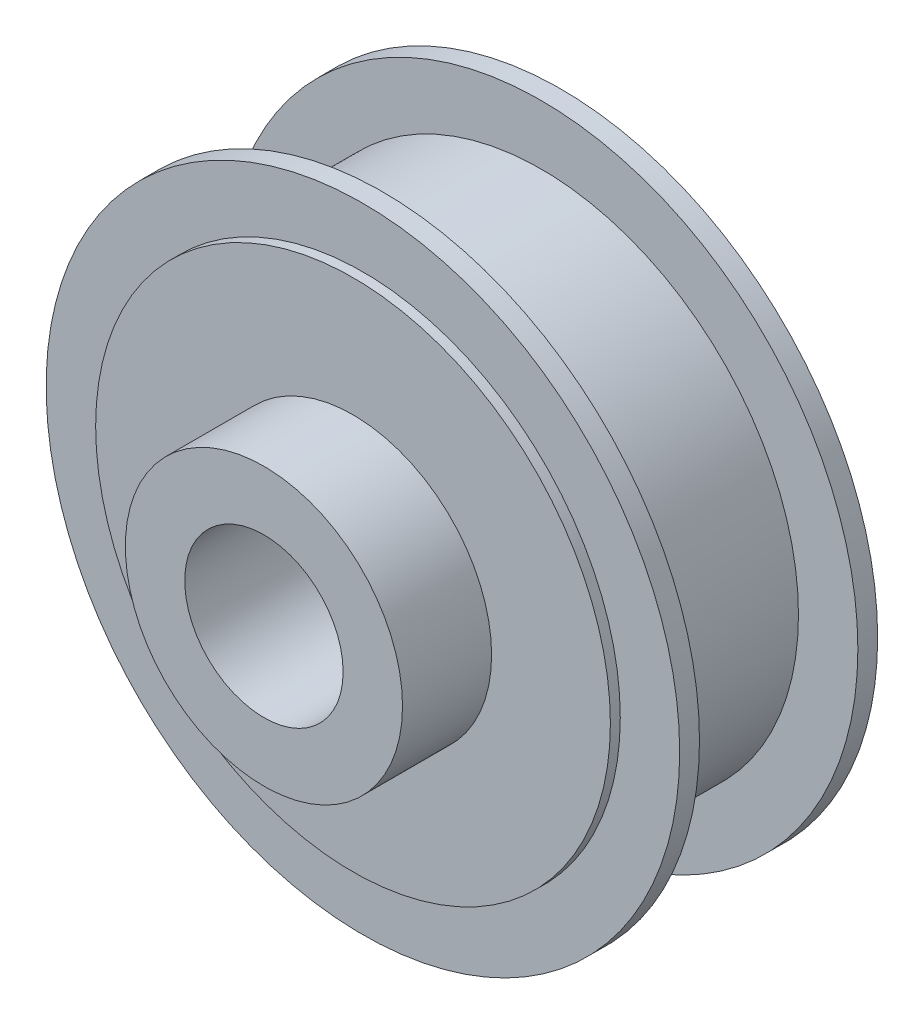
ISO-10303-21;
HEADER;
FILE_DESCRIPTION(('STEP AP214'),'2;1');
FILE_NAME('part.step','',(''),(''),'','','');
FILE_SCHEMA(('AUTOMOTIVE_DESIGN { 1 0 10303 214 1 1 1 1 }'));
ENDSEC;
DATA;
#1=APPLICATION_CONTEXT('core data for automotive mechanical design processes');
#2=APPLICATION_PROTOCOL_DEFINITION('international standard','automotive_design',2000,#1);
#3=PRODUCT_CONTEXT('',#1,'mechanical');
#4=PRODUCT('Part','Part','',(#3));
#5=PRODUCT_RELATED_PRODUCT_CATEGORY('part','',(#4));
#6=PRODUCT_DEFINITION_FORMATION('','',#4);
#7=PRODUCT_DEFINITION_CONTEXT('part definition',#1,'design');
#8=PRODUCT_DEFINITION('design','',#6,#7);
#9=PRODUCT_DEFINITION_SHAPE('','',#8);
#10=(LENGTH_UNIT() NAMED_UNIT(*) SI_UNIT(.MILLI.,.METRE.));
#11=(NAMED_UNIT(*) PLANE_ANGLE_UNIT() SI_UNIT($,.RADIAN.));
#12=(NAMED_UNIT(*) SI_UNIT($,.STERADIAN.) SOLID_ANGLE_UNIT());
#13=UNCERTAINTY_MEASURE_WITH_UNIT(LENGTH_MEASURE(1.E-05),#10,'distance_accuracy_value','');
#14=(GEOMETRIC_REPRESENTATION_CONTEXT(3) GLOBAL_UNCERTAINTY_ASSIGNED_CONTEXT((#13)) GLOBAL_UNIT_ASSIGNED_CONTEXT((#10,
#11,#12)) REPRESENTATION_CONTEXT('',''));
#15=CARTESIAN_POINT('',(0.,0.,0.));
#16=DIRECTION('',(0.,0.,1.));
#17=DIRECTION('',(1.,0.,0.));
#18=AXIS2_PLACEMENT_3D('',#15,#16,#17);
#19=CARTESIAN_POINT('',(0.,0.,1.));
#20=DIRECTION('',(0.,0.,-1.));
#21=DIRECTION('',(-1.,0.,0.));
#22=AXIS2_PLACEMENT_3D('',#19,#20,#21);
#23=CYLINDRICAL_SURFACE('',#22,16.);
#24=CARTESIAN_POINT('',(0.,0.,1.));
#25=DIRECTION('',(0.,0.,1.));
#26=DIRECTION('',(1.,0.,0.));
#27=AXIS2_PLACEMENT_3D('',#24,#25,#26);
#28=CIRCLE('',#27,16.);
#29=CARTESIAN_POINT('',(16.,0.,1.));
#30=VERTEX_POINT('',#29);
#31=EDGE_CURVE('E46',#30,#30,#28,.T.);
#32=ORIENTED_EDGE('',*,*,#31,.F.);
#33=EDGE_LOOP('',(#32));
#34=FACE_BOUND('',#33,.T.);
#35=CARTESIAN_POINT('',(0.,0.,0.));
#36=DIRECTION('',(0.,0.,1.));
#37=DIRECTION('',(1.,0.,0.));
#38=AXIS2_PLACEMENT_3D('',#35,#36,#37);
#39=CIRCLE('',#38,16.);
#40=CARTESIAN_POINT('',(16.,0.,0.));
#41=VERTEX_POINT('',#40);
#42=EDGE_CURVE('E70',#41,#41,#39,.T.);
#43=ORIENTED_EDGE('',*,*,#42,.T.);
#44=EDGE_LOOP('',(#43));
#45=FACE_BOUND('',#44,.T.);
#46=ADVANCED_FACE('F34',(#34,#45),#23,.T.);
#47=CARTESIAN_POINT('',(0.,0.,1.));
#48=DIRECTION('',(0.,0.,1.));
#49=DIRECTION('',(1.,0.,0.));
#50=AXIS2_PLACEMENT_3D('',#47,#48,#49);
#51=PLANE('',#50);
#52=CARTESIAN_POINT('',(0.,0.,1.));
#53=DIRECTION('',(0.,0.,1.));
#54=DIRECTION('',(1.,0.,0.));
#55=AXIS2_PLACEMENT_3D('',#52,#53,#54);
#56=CIRCLE('',#55,13.);
#57=CARTESIAN_POINT('',(13.,0.,1.));
#58=VERTEX_POINT('',#57);
#59=EDGE_CURVE('E41',#58,#58,#56,.T.);
#60=ORIENTED_EDGE('',*,*,#59,.F.);
#61=EDGE_LOOP('',(#60));
#62=FACE_BOUND('',#61,.T.);
#63=ORIENTED_EDGE('',*,*,#31,.T.);
#64=EDGE_LOOP('',(#63));
#65=FACE_BOUND('',#64,.T.);
#66=ADVANCED_FACE('F114',(#62,#65),#51,.T.);
#67=CARTESIAN_POINT('',(0.,0.,0.));
#68=DIRECTION('',(0.,0.,1.));
#69=DIRECTION('',(1.,0.,0.));
#70=AXIS2_PLACEMENT_3D('',#67,#68,#69);
#71=PLANE('',#70);
#72=CARTESIAN_POINT('',(0.,0.,0.));
#73=DIRECTION('',(0.,0.,-1.));
#74=DIRECTION('',(-1.,0.,0.));
#75=AXIS2_PLACEMENT_3D('',#72,#73,#74);
#76=CIRCLE('',#75,13.);
#77=CARTESIAN_POINT('',(-13.,0.,0.));
#78=VERTEX_POINT('',#77);
#79=EDGE_CURVE('E10',#78,#78,#76,.T.);
#80=ORIENTED_EDGE('',*,*,#79,.F.);
#81=EDGE_LOOP('',(#80));
#82=FACE_BOUND('',#81,.T.);
#83=ORIENTED_EDGE('',*,*,#42,.F.);
#84=EDGE_LOOP('',(#83));
#85=FACE_BOUND('',#84,.T.);
#86=ADVANCED_FACE('F119',(#82,#85),#71,.F.);
#87=CARTESIAN_POINT('',(0.,0.,9.));
#88=DIRECTION('',(0.,0.,-1.));
#89=DIRECTION('',(-1.,0.,0.));
#90=AXIS2_PLACEMENT_3D('',#87,#88,#89);
#91=CYLINDRICAL_SURFACE('',#90,13.);
#92=CARTESIAN_POINT('',(0.,0.,9.));
#93=DIRECTION('',(0.,0.,1.));
#94=DIRECTION('',(1.,0.,0.));
#95=AXIS2_PLACEMENT_3D('',#92,#93,#94);
#96=CIRCLE('',#95,13.);
#97=CARTESIAN_POINT('',(13.,0.,9.));
#98=VERTEX_POINT('',#97);
#99=EDGE_CURVE('E66',#98,#98,#96,.T.);
#100=ORIENTED_EDGE('',*,*,#99,.F.);
#101=EDGE_LOOP('',(#100));
#102=FACE_BOUND('',#101,.T.);
#103=ORIENTED_EDGE('',*,*,#59,.T.);
#104=EDGE_LOOP('',(#103));
#105=FACE_BOUND('',#104,.T.);
#106=ADVANCED_FACE('F104',(#102,#105),#91,.T.);
#107=CARTESIAN_POINT('',(0.,0.,10.));
#108=DIRECTION('',(0.,0.,-1.));
#109=DIRECTION('',(-1.,0.,0.));
#110=AXIS2_PLACEMENT_3D('',#107,#108,#109);
#111=CYLINDRICAL_SURFACE('',#110,16.);
#112=CARTESIAN_POINT('',(0.,0.,10.));
#113=DIRECTION('',(0.,0.,1.));
#114=DIRECTION('',(1.,0.,0.));
#115=AXIS2_PLACEMENT_3D('',#112,#113,#114);
#116=CIRCLE('',#115,16.);
#117=CARTESIAN_POINT('',(16.,0.,10.));
#118=VERTEX_POINT('',#117);
#119=EDGE_CURVE('E63',#118,#118,#116,.T.);
#120=ORIENTED_EDGE('',*,*,#119,.F.);
#121=EDGE_LOOP('',(#120));
#122=FACE_BOUND('',#121,.T.);
#123=CARTESIAN_POINT('',(0.,0.,9.));
#124=DIRECTION('',(0.,0.,1.));
#125=DIRECTION('',(1.,0.,0.));
#126=AXIS2_PLACEMENT_3D('',#123,#124,#125);
#127=CIRCLE('',#126,16.);
#128=CARTESIAN_POINT('',(16.,0.,9.));
#129=VERTEX_POINT('',#128);
#130=EDGE_CURVE('E62',#129,#129,#127,.T.);
#131=ORIENTED_EDGE('',*,*,#130,.T.);
#132=EDGE_LOOP('',(#131));
#133=FACE_BOUND('',#132,.T.);
#134=ADVANCED_FACE('F98',(#122,#133),#111,.T.);
#135=CARTESIAN_POINT('',(0.,0.,10.));
#136=DIRECTION('',(0.,0.,1.));
#137=DIRECTION('',(1.,0.,0.));
#138=AXIS2_PLACEMENT_3D('',#135,#136,#137);
#139=PLANE('',#138);
#140=CARTESIAN_POINT('',(0.,0.,10.));
#141=DIRECTION('',(0.,0.,1.));
#142=DIRECTION('',(1.,0.,0.));
#143=AXIS2_PLACEMENT_3D('',#140,#141,#142);
#144=CIRCLE('',#143,13.);
#145=CARTESIAN_POINT('',(13.,0.,10.));
#146=VERTEX_POINT('',#145);
#147=EDGE_CURVE('E56',#146,#146,#144,.T.);
#148=ORIENTED_EDGE('',*,*,#147,.F.);
#149=EDGE_LOOP('',(#148));
#150=FACE_BOUND('',#149,.T.);
#151=ORIENTED_EDGE('',*,*,#119,.T.);
#152=EDGE_LOOP('',(#151));
#153=FACE_BOUND('',#152,.T.);
#154=ADVANCED_FACE('F95',(#150,#153),#139,.T.);
#155=CARTESIAN_POINT('',(0.,0.,9.));
#156=DIRECTION('',(0.,0.,1.));
#157=DIRECTION('',(1.,0.,0.));
#158=AXIS2_PLACEMENT_3D('',#155,#156,#157);
#159=PLANE('',#158);
#160=ORIENTED_EDGE('',*,*,#99,.T.);
#161=EDGE_LOOP('',(#160));
#162=FACE_BOUND('',#161,.T.);
#163=ORIENTED_EDGE('',*,*,#130,.F.);
#164=EDGE_LOOP('',(#163));
#165=FACE_BOUND('',#164,.T.);
#166=ADVANCED_FACE('F91',(#162,#165),#159,.F.);
#167=CARTESIAN_POINT('',(0.,0.,10.5));
#168=DIRECTION('',(0.,0.,-1.));
#169=DIRECTION('',(-1.,0.,0.));
#170=AXIS2_PLACEMENT_3D('',#167,#168,#169);
#171=CYLINDRICAL_SURFACE('',#170,13.);
#172=CARTESIAN_POINT('',(0.,0.,10.5));
#173=DIRECTION('',(0.,0.,1.));
#174=DIRECTION('',(1.,0.,0.));
#175=AXIS2_PLACEMENT_3D('',#172,#173,#174);
#176=CIRCLE('',#175,13.);
#177=CARTESIAN_POINT('',(13.,0.,10.5));
#178=VERTEX_POINT('',#177);
#179=EDGE_CURVE('E52',#178,#178,#176,.T.);
#180=ORIENTED_EDGE('',*,*,#179,.F.);
#181=EDGE_LOOP('',(#180));
#182=FACE_BOUND('',#181,.T.);
#183=ORIENTED_EDGE('',*,*,#147,.T.);
#184=EDGE_LOOP('',(#183));
#185=FACE_BOUND('',#184,.T.);
#186=ADVANCED_FACE('F85',(#182,#185),#171,.T.);
#187=CARTESIAN_POINT('',(0.,0.,10.5));
#188=DIRECTION('',(0.,0.,1.));
#189=DIRECTION('',(1.,0.,0.));
#190=AXIS2_PLACEMENT_3D('',#187,#188,#189);
#191=PLANE('',#190);
#192=CARTESIAN_POINT('',(0.,0.,10.5));
#193=DIRECTION('',(0.,0.,1.));
#194=DIRECTION('',(1.,0.,0.));
#195=AXIS2_PLACEMENT_3D('',#192,#193,#194);
#196=CIRCLE('',#195,7.);
#197=CARTESIAN_POINT('',(7.,0.,10.5));
#198=VERTEX_POINT('',#197);
#199=EDGE_CURVE('E55',#198,#198,#196,.T.);
#200=ORIENTED_EDGE('',*,*,#199,.F.);
#201=EDGE_LOOP('',(#200));
#202=FACE_BOUND('',#201,.T.);
#203=ORIENTED_EDGE('',*,*,#179,.T.);
#204=EDGE_LOOP('',(#203));
#205=FACE_BOUND('',#204,.T.);
#206=ADVANCED_FACE('F81',(#202,#205),#191,.T.);
#207=CARTESIAN_POINT('',(0.,0.,15.));
#208=DIRECTION('',(0.,0.,1.));
#209=DIRECTION('',(1.,0.,0.));
#210=AXIS2_PLACEMENT_3D('',#207,#208,#209);
#211=PLANE('',#210);
#212=CARTESIAN_POINT('',(0.,0.,15.));
#213=DIRECTION('',(0.,0.,1.));
#214=DIRECTION('',(1.,0.,0.));
#215=AXIS2_PLACEMENT_3D('',#212,#213,#214);
#216=CIRCLE('',#215,4.);
#217=CARTESIAN_POINT('',(4.,0.,15.));
#218=VERTEX_POINT('',#217);
#219=EDGE_CURVE('E223',#218,#218,#216,.T.);
#220=ORIENTED_EDGE('',*,*,#219,.F.);
#221=EDGE_LOOP('',(#220));
#222=FACE_BOUND('',#221,.T.);
#223=CARTESIAN_POINT('',(0.,0.,15.));
#224=DIRECTION('',(0.,0.,1.));
#225=DIRECTION('',(1.,0.,0.));
#226=AXIS2_PLACEMENT_3D('',#223,#224,#225);
#227=CIRCLE('',#226,7.);
#228=CARTESIAN_POINT('',(7.,0.,15.));
#229=VERTEX_POINT('',#228);
#230=EDGE_CURVE('E59',#229,#229,#227,.T.);
#231=ORIENTED_EDGE('',*,*,#230,.T.);
#232=EDGE_LOOP('',(#231));
#233=FACE_BOUND('',#232,.T.);
#234=ADVANCED_FACE('F84',(#222,#233),#211,.T.);
#235=CARTESIAN_POINT('',(0.,0.,15.));
#236=DIRECTION('',(0.,0.,-1.));
#237=DIRECTION('',(-1.,0.,0.));
#238=AXIS2_PLACEMENT_3D('',#235,#236,#237);
#239=CYLINDRICAL_SURFACE('',#238,7.);
#240=ORIENTED_EDGE('',*,*,#199,.T.);
#241=EDGE_LOOP('',(#240));
#242=FACE_BOUND('',#241,.T.);
#243=ORIENTED_EDGE('',*,*,#230,.F.);
#244=EDGE_LOOP('',(#243));
#245=FACE_BOUND('',#244,.T.);
#246=ADVANCED_FACE('F78',(#242,#245),#239,.T.);
#247=CARTESIAN_POINT('',(0.,0.,-0.5));
#248=DIRECTION('',(0.,0.,1.));
#249=DIRECTION('',(1.,0.,0.));
#250=AXIS2_PLACEMENT_3D('',#247,#248,#249);
#251=CYLINDRICAL_SURFACE('',#250,13.);
#252=CARTESIAN_POINT('',(0.,0.,-0.5));
#253=DIRECTION('',(0.,0.,-1.));
#254=DIRECTION('',(-1.,0.,0.));
#255=AXIS2_PLACEMENT_3D('',#252,#253,#254);
#256=CIRCLE('',#255,13.);
#257=CARTESIAN_POINT('',(-13.,0.,-0.5));
#258=VERTEX_POINT('',#257);
#259=EDGE_CURVE('E50',#258,#258,#256,.T.);
#260=ORIENTED_EDGE('',*,*,#259,.F.);
#261=EDGE_LOOP('',(#260));
#262=FACE_BOUND('',#261,.T.);
#263=ORIENTED_EDGE('',*,*,#79,.T.);
#264=EDGE_LOOP('',(#263));
#265=FACE_BOUND('',#264,.T.);
#266=ADVANCED_FACE('F173',(#262,#265),#251,.T.);
#267=CARTESIAN_POINT('',(0.,0.,-0.5));
#268=DIRECTION('',(0.,0.,-1.));
#269=DIRECTION('',(-1.,0.,0.));
#270=AXIS2_PLACEMENT_3D('',#267,#268,#269);
#271=PLANE('',#270);
#272=CARTESIAN_POINT('',(0.,0.,-0.5));
#273=DIRECTION('',(0.,0.,-1.));
#274=DIRECTION('',(-1.,0.,0.));
#275=AXIS2_PLACEMENT_3D('',#272,#273,#274);
#276=CIRCLE('',#275,4.);
#277=CARTESIAN_POINT('',(-4.,0.,-0.5));
#278=VERTEX_POINT('',#277);
#279=EDGE_CURVE('E37',#278,#278,#276,.T.);
#280=ORIENTED_EDGE('',*,*,#279,.F.);
#281=EDGE_LOOP('',(#280));
#282=FACE_BOUND('',#281,.T.);
#283=ORIENTED_EDGE('',*,*,#259,.T.);
#284=EDGE_LOOP('',(#283));
#285=FACE_BOUND('',#284,.T.);
#286=ADVANCED_FACE('F187',(#282,#285),#271,.T.);
#287=CARTESIAN_POINT('',(0.,0.,-0.999999999999997));
#288=DIRECTION('',(0.,0.,1.));
#289=DIRECTION('',(1.,0.,0.));
#290=AXIS2_PLACEMENT_3D('',#287,#288,#289);
#291=CYLINDRICAL_SURFACE('',#290,4.);
#292=ORIENTED_EDGE('',*,*,#279,.T.);
#293=EDGE_LOOP('',(#292));
#294=FACE_BOUND('',#293,.T.);
#295=ORIENTED_EDGE('',*,*,#219,.T.);
#296=EDGE_LOOP('',(#295));
#297=FACE_BOUND('',#296,.T.);
#298=ADVANCED_FACE('F204',(#294,#297),#291,.F.);
#299=CLOSED_SHELL('',(#46,#66,#86,#106,#134,#154,#166,#186,#206,#234,#246,#266,#286,#298));
#300=MANIFOLD_SOLID_BREP('B2',#299);
#301=ADVANCED_BREP_SHAPE_REPRESENTATION('',(#18,#300),#14);
#302=SHAPE_DEFINITION_REPRESENTATION(#9,#301);
ENDSEC;
END-ISO-10303-21;
